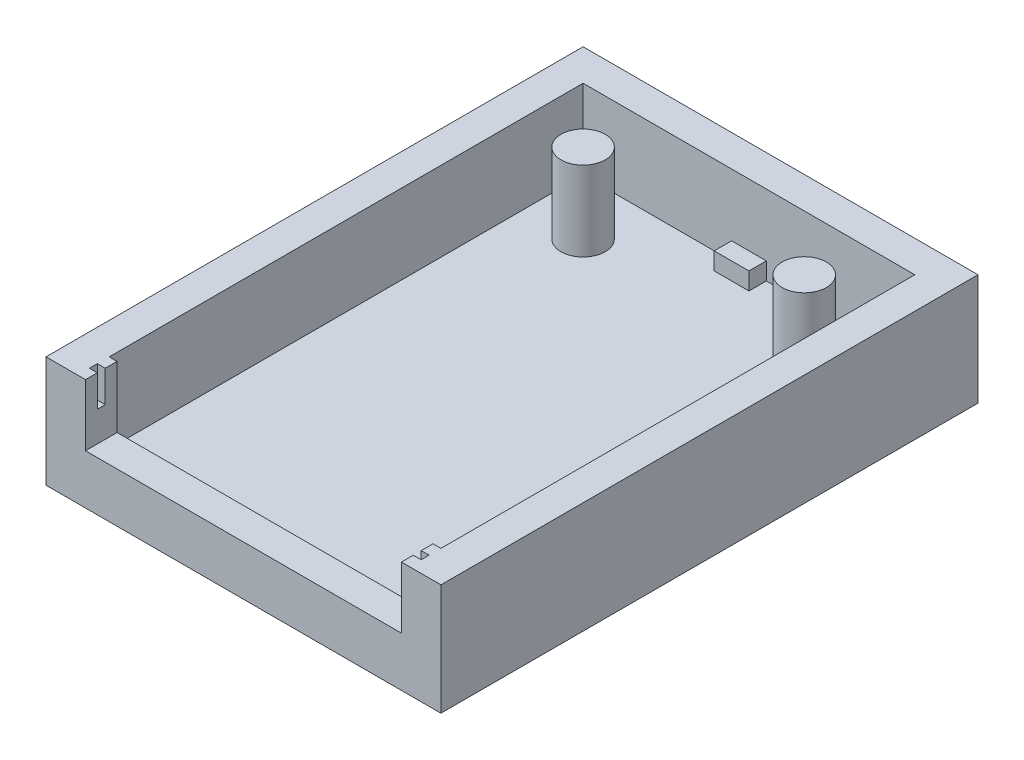
ISO-10303-21;
HEADER;
FILE_DESCRIPTION(('STEP AP214'),'2;1');
FILE_NAME('part.step','',(''),(''),'','','');
FILE_SCHEMA(('AUTOMOTIVE_DESIGN { 1 0 10303 214 1 1 1 1 }'));
ENDSEC;
DATA;
#1=APPLICATION_CONTEXT('core data for automotive mechanical design processes');
#2=APPLICATION_PROTOCOL_DEFINITION('international standard','automotive_design',2000,#1);
#3=PRODUCT_CONTEXT('',#1,'mechanical');
#4=PRODUCT('Part','Part','',(#3));
#5=PRODUCT_RELATED_PRODUCT_CATEGORY('part','',(#4));
#6=PRODUCT_DEFINITION_FORMATION('','',#4);
#7=PRODUCT_DEFINITION_CONTEXT('part definition',#1,'design');
#8=PRODUCT_DEFINITION('design','',#6,#7);
#9=PRODUCT_DEFINITION_SHAPE('','',#8);
#10=(LENGTH_UNIT() NAMED_UNIT(*) SI_UNIT(.MILLI.,.METRE.));
#11=(NAMED_UNIT(*) PLANE_ANGLE_UNIT() SI_UNIT($,.RADIAN.));
#12=(NAMED_UNIT(*) SI_UNIT($,.STERADIAN.) SOLID_ANGLE_UNIT());
#13=UNCERTAINTY_MEASURE_WITH_UNIT(LENGTH_MEASURE(1.E-05),#10,'distance_accuracy_value','');
#14=(GEOMETRIC_REPRESENTATION_CONTEXT(3) GLOBAL_UNCERTAINTY_ASSIGNED_CONTEXT((#13)) GLOBAL_UNIT_ASSIGNED_CONTEXT((#10,
#11,#12)) REPRESENTATION_CONTEXT('',''));
#15=CARTESIAN_POINT('',(0.,0.,0.));
#16=DIRECTION('',(0.,0.,1.));
#17=DIRECTION('',(1.,0.,0.));
#18=AXIS2_PLACEMENT_3D('',#15,#16,#17);
#19=CARTESIAN_POINT('',(-10.5,2.,-15.));
#20=DIRECTION('',(0.,0.,-1.));
#21=DIRECTION('',(-1.,0.,0.));
#22=AXIS2_PLACEMENT_3D('',#19,#20,#21);
#23=PLANE('',#22);
#24=DIRECTION('',(0.,-1.,0.));
#25=VECTOR('',#24,1.);
#26=CARTESIAN_POINT('',(-1.10000000000001,3.1,-15.));
#27=LINE('',#26,#25);
#28=CARTESIAN_POINT('',(-1.10000000000001,3.1,-15.));
#29=VERTEX_POINT('',#28);
#30=CARTESIAN_POINT('',(-1.10000000000001,2.,-15.));
#31=VERTEX_POINT('',#30);
#32=EDGE_CURVE('E284',#29,#31,#27,.T.);
#33=ORIENTED_EDGE('',*,*,#32,.F.);
#34=DIRECTION('',(-1.,0.,0.));
#35=VECTOR('',#34,1.);
#36=CARTESIAN_POINT('',(-1.10000000000001,3.1,-15.));
#37=LINE('',#36,#35);
#38=CARTESIAN_POINT('',(1.10000000000001,3.1,-15.));
#39=VERTEX_POINT('',#38);
#40=EDGE_CURVE('E281',#39,#29,#37,.T.);
#41=ORIENTED_EDGE('',*,*,#40,.F.);
#42=DIRECTION('',(0.,-1.,0.));
#43=VECTOR('',#42,1.);
#44=CARTESIAN_POINT('',(1.10000000000001,3.1,-15.));
#45=LINE('',#44,#43);
#46=CARTESIAN_POINT('',(1.10000000000001,2.,-15.));
#47=VERTEX_POINT('',#46);
#48=EDGE_CURVE('E296',#39,#47,#45,.T.);
#49=ORIENTED_EDGE('',*,*,#48,.T.);
#50=DIRECTION('',(-1.,0.,0.));
#51=VECTOR('',#50,1.);
#52=CARTESIAN_POINT('',(-10.5,2.,-15.));
#53=LINE('',#52,#51);
#54=CARTESIAN_POINT('',(10.5,2.,-15.));
#55=VERTEX_POINT('',#54);
#56=EDGE_CURVE('E357',#55,#47,#53,.T.);
#57=ORIENTED_EDGE('',*,*,#56,.F.);
#58=DIRECTION('',(0.,1.,0.));
#59=VECTOR('',#58,1.);
#60=CARTESIAN_POINT('',(10.5,2.,-15.));
#61=LINE('',#60,#59);
#62=CARTESIAN_POINT('',(10.5,7.04,-15.));
#63=VERTEX_POINT('',#62);
#64=EDGE_CURVE('E369',#55,#63,#61,.T.);
#65=ORIENTED_EDGE('',*,*,#64,.T.);
#66=DIRECTION('',(-1.,0.,0.));
#67=VECTOR('',#66,1.);
#68=CARTESIAN_POINT('',(-10.5,7.04,-15.));
#69=LINE('',#68,#67);
#70=CARTESIAN_POINT('',(-10.5,7.04,-15.));
#71=VERTEX_POINT('',#70);
#72=EDGE_CURVE('E372',#63,#71,#69,.T.);
#73=ORIENTED_EDGE('',*,*,#72,.T.);
#74=DIRECTION('',(0.,1.,0.));
#75=VECTOR('',#74,1.);
#76=CARTESIAN_POINT('',(-10.5,2.,-15.));
#77=LINE('',#76,#75);
#78=CARTESIAN_POINT('',(-10.5,2.,-15.));
#79=VERTEX_POINT('',#78);
#80=EDGE_CURVE('E392',#79,#71,#77,.T.);
#81=ORIENTED_EDGE('',*,*,#80,.F.);
#82=EDGE_CURVE('E355',#31,#79,#53,.T.);
#83=ORIENTED_EDGE('',*,*,#82,.F.);
#84=EDGE_LOOP('',(#33,#41,#49,#57,#65,#73,#81,#83));
#85=FACE_BOUND('',#84,.T.);
#86=ADVANCED_FACE('F44',(#85),#23,.F.);
#87=CARTESIAN_POINT('',(0.,2.,0.));
#88=DIRECTION('',(0.,1.,0.));
#89=DIRECTION('',(0.,0.,1.));
#90=AXIS2_PLACEMENT_3D('',#87,#88,#89);
#91=PLANE('',#90);
#92=CARTESIAN_POINT('',(7.,2.,-11.5));
#93=DIRECTION('',(0.,1.,0.));
#94=DIRECTION('',(0.,0.,1.));
#95=AXIS2_PLACEMENT_3D('',#92,#93,#94);
#96=CIRCLE('',#95,1.4);
#97=CARTESIAN_POINT('',(7.,2.,-10.1));
#98=VERTEX_POINT('',#97);
#99=EDGE_CURVE('E335',#98,#98,#96,.T.);
#100=ORIENTED_EDGE('',*,*,#99,.F.);
#101=EDGE_LOOP('',(#100));
#102=FACE_BOUND('',#101,.T.);
#103=CARTESIAN_POINT('',(-7.,2.,-11.5));
#104=DIRECTION('',(0.,1.,0.));
#105=DIRECTION('',(0.,0.,1.));
#106=AXIS2_PLACEMENT_3D('',#103,#104,#105);
#107=CIRCLE('',#106,1.4);
#108=CARTESIAN_POINT('',(-7.,2.,-10.1));
#109=VERTEX_POINT('',#108);
#110=EDGE_CURVE('E343',#109,#109,#107,.T.);
#111=ORIENTED_EDGE('',*,*,#110,.F.);
#112=EDGE_LOOP('',(#111));
#113=FACE_BOUND('',#112,.T.);
#114=DIRECTION('',(1.,0.,0.));
#115=VECTOR('',#114,1.);
#116=CARTESIAN_POINT('',(-1.09999999999999,2.,-13.9));
#117=LINE('',#116,#115);
#118=CARTESIAN_POINT('',(-1.09999999999999,2.,-13.9));
#119=VERTEX_POINT('',#118);
#120=CARTESIAN_POINT('',(1.10000000000001,2.,-13.9));
#121=VERTEX_POINT('',#120);
#122=EDGE_CURVE('E288',#119,#121,#117,.T.);
#123=ORIENTED_EDGE('',*,*,#122,.F.);
#124=DIRECTION('',(0.,0.,1.));
#125=VECTOR('',#124,1.);
#126=CARTESIAN_POINT('',(-1.10000000000001,2.,-15.));
#127=LINE('',#126,#125);
#128=EDGE_CURVE('E244',#31,#119,#127,.T.);
#129=ORIENTED_EDGE('',*,*,#128,.F.);
#130=ORIENTED_EDGE('',*,*,#82,.T.);
#131=DIRECTION('',(0.,0.,1.));
#132=VECTOR('',#131,1.);
#133=CARTESIAN_POINT('',(-10.5,2.,-15.));
#134=LINE('',#133,#132);
#135=CARTESIAN_POINT('',(-10.5,2.,15.));
#136=VERTEX_POINT('',#135);
#137=EDGE_CURVE('E361',#79,#136,#134,.T.);
#138=ORIENTED_EDGE('',*,*,#137,.T.);
#139=DIRECTION('',(1.,0.,0.));
#140=VECTOR('',#139,1.);
#141=CARTESIAN_POINT('',(-10.5,2.,15.));
#142=LINE('',#141,#140);
#143=CARTESIAN_POINT('',(10.5,2.,15.));
#144=VERTEX_POINT('',#143);
#145=EDGE_CURVE('E365',#136,#144,#142,.T.);
#146=ORIENTED_EDGE('',*,*,#145,.T.);
#147=DIRECTION('',(0.,0.,-1.));
#148=VECTOR('',#147,1.);
#149=CARTESIAN_POINT('',(10.5,2.,-15.));
#150=LINE('',#149,#148);
#151=EDGE_CURVE('E351',#144,#55,#150,.T.);
#152=ORIENTED_EDGE('',*,*,#151,.T.);
#153=ORIENTED_EDGE('',*,*,#56,.T.);
#154=DIRECTION('',(0.,0.,-1.));
#155=VECTOR('',#154,1.);
#156=CARTESIAN_POINT('',(1.10000000000001,2.,-15.));
#157=LINE('',#156,#155);
#158=EDGE_CURVE('E275',#121,#47,#157,.T.);
#159=ORIENTED_EDGE('',*,*,#158,.F.);
#160=EDGE_LOOP('',(#123,#129,#130,#138,#146,#152,#153,#159));
#161=FACE_BOUND('',#160,.T.);
#162=ADVANCED_FACE('F533',(#102,#113,#161),#91,.T.);
#163=CARTESIAN_POINT('',(12.5,7.04,-17.));
#164=DIRECTION('',(-1.,0.,0.));
#165=DIRECTION('',(0.,0.,1.));
#166=AXIS2_PLACEMENT_3D('',#163,#164,#165);
#167=PLANE('',#166);
#168=DIRECTION('',(0.,0.,-1.));
#169=VECTOR('',#168,1.);
#170=CARTESIAN_POINT('',(12.5,0.,-17.));
#171=LINE('',#170,#169);
#172=CARTESIAN_POINT('',(12.5,0.,17.));
#173=VERTEX_POINT('',#172);
#174=CARTESIAN_POINT('',(12.5,0.,-17.));
#175=VERTEX_POINT('',#174);
#176=EDGE_CURVE('E388',#173,#175,#171,.T.);
#177=ORIENTED_EDGE('',*,*,#176,.T.);
#178=DIRECTION('',(0.,-1.,0.));
#179=VECTOR('',#178,1.);
#180=CARTESIAN_POINT('',(12.5,7.04,-17.));
#181=LINE('',#180,#179);
#182=CARTESIAN_POINT('',(12.5,7.04,-17.));
#183=VERTEX_POINT('',#182);
#184=EDGE_CURVE('E437',#183,#175,#181,.T.);
#185=ORIENTED_EDGE('',*,*,#184,.F.);
#186=DIRECTION('',(0.,0.,-1.));
#187=VECTOR('',#186,1.);
#188=CARTESIAN_POINT('',(12.5,7.04,-17.));
#189=LINE('',#188,#187);
#190=CARTESIAN_POINT('',(12.5,7.04,17.));
#191=VERTEX_POINT('',#190);
#192=EDGE_CURVE('E398',#191,#183,#189,.T.);
#193=ORIENTED_EDGE('',*,*,#192,.F.);
#194=DIRECTION('',(0.,-1.,0.));
#195=VECTOR('',#194,1.);
#196=CARTESIAN_POINT('',(12.5,7.04,17.));
#197=LINE('',#196,#195);
#198=EDGE_CURVE('E414',#191,#173,#197,.T.);
#199=ORIENTED_EDGE('',*,*,#198,.T.);
#200=EDGE_LOOP('',(#177,#185,#193,#199));
#201=FACE_BOUND('',#200,.T.);
#202=ADVANCED_FACE('F46',(#201),#167,.F.);
#203=CARTESIAN_POINT('',(-12.5,7.04,-17.));
#204=DIRECTION('',(0.,0.,1.));
#205=DIRECTION('',(1.,0.,0.));
#206=AXIS2_PLACEMENT_3D('',#203,#204,#205);
#207=PLANE('',#206);
#208=DIRECTION('',(-1.,0.,0.));
#209=VECTOR('',#208,1.);
#210=CARTESIAN_POINT('',(-12.5,0.,-17.));
#211=LINE('',#210,#209);
#212=CARTESIAN_POINT('',(-12.5,0.,-17.));
#213=VERTEX_POINT('',#212);
#214=EDGE_CURVE('E418',#175,#213,#211,.T.);
#215=ORIENTED_EDGE('',*,*,#214,.T.);
#216=DIRECTION('',(0.,-1.,0.));
#217=VECTOR('',#216,1.);
#218=CARTESIAN_POINT('',(-12.5,7.04,-17.));
#219=LINE('',#218,#217);
#220=CARTESIAN_POINT('',(-12.5,7.04,-17.));
#221=VERTEX_POINT('',#220);
#222=EDGE_CURVE('E433',#221,#213,#219,.T.);
#223=ORIENTED_EDGE('',*,*,#222,.F.);
#224=DIRECTION('',(-1.,0.,0.));
#225=VECTOR('',#224,1.);
#226=CARTESIAN_POINT('',(-12.5,7.04,-17.));
#227=LINE('',#226,#225);
#228=EDGE_CURVE('E402',#183,#221,#227,.T.);
#229=ORIENTED_EDGE('',*,*,#228,.F.);
#230=ORIENTED_EDGE('',*,*,#184,.T.);
#231=EDGE_LOOP('',(#215,#223,#229,#230));
#232=FACE_BOUND('',#231,.T.);
#233=ADVANCED_FACE('F495',(#232),#207,.F.);
#234=CARTESIAN_POINT('',(-12.5,7.04,-17.));
#235=DIRECTION('',(1.,0.,0.));
#236=DIRECTION('',(0.,0.,-1.));
#237=AXIS2_PLACEMENT_3D('',#234,#235,#236);
#238=PLANE('',#237);
#239=DIRECTION('',(0.,0.,1.));
#240=VECTOR('',#239,1.);
#241=CARTESIAN_POINT('',(-12.5,0.,-17.));
#242=LINE('',#241,#240);
#243=CARTESIAN_POINT('',(-12.5,0.,17.));
#244=VERTEX_POINT('',#243);
#245=EDGE_CURVE('E421',#213,#244,#242,.T.);
#246=ORIENTED_EDGE('',*,*,#245,.T.);
#247=DIRECTION('',(0.,-1.,0.));
#248=VECTOR('',#247,1.);
#249=CARTESIAN_POINT('',(-12.5,7.04,17.));
#250=LINE('',#249,#248);
#251=CARTESIAN_POINT('',(-12.5,7.04,17.));
#252=VERTEX_POINT('',#251);
#253=EDGE_CURVE('E429',#252,#244,#250,.T.);
#254=ORIENTED_EDGE('',*,*,#253,.F.);
#255=DIRECTION('',(0.,0.,1.));
#256=VECTOR('',#255,1.);
#257=CARTESIAN_POINT('',(-12.5,7.04,-17.));
#258=LINE('',#257,#256);
#259=EDGE_CURVE('E406',#221,#252,#258,.T.);
#260=ORIENTED_EDGE('',*,*,#259,.F.);
#261=ORIENTED_EDGE('',*,*,#222,.T.);
#262=EDGE_LOOP('',(#246,#254,#260,#261));
#263=FACE_BOUND('',#262,.T.);
#264=ADVANCED_FACE('F502',(#263),#238,.F.);
#265=CARTESIAN_POINT('',(-12.5,7.04,17.));
#266=DIRECTION('',(0.,0.,-1.));
#267=DIRECTION('',(-1.,0.,0.));
#268=AXIS2_PLACEMENT_3D('',#265,#266,#267);
#269=PLANE('',#268);
#270=DIRECTION('',(1.,0.,0.));
#271=VECTOR('',#270,1.);
#272=CARTESIAN_POINT('',(-12.5,7.04,17.));
#273=LINE('',#272,#271);
#274=CARTESIAN_POINT('',(10.,7.04,17.));
#275=VERTEX_POINT('',#274);
#276=EDGE_CURVE('E409',#275,#191,#273,.T.);
#277=ORIENTED_EDGE('',*,*,#276,.F.);
#278=DIRECTION('',(0.,-1.,0.));
#279=VECTOR('',#278,1.);
#280=CARTESIAN_POINT('',(10.,7.04,17.));
#281=LINE('',#280,#279);
#282=CARTESIAN_POINT('',(10.,3.14,17.));
#283=VERTEX_POINT('',#282);
#284=EDGE_CURVE('E330',#275,#283,#281,.T.);
#285=ORIENTED_EDGE('',*,*,#284,.T.);
#286=DIRECTION('',(1.,0.,0.));
#287=VECTOR('',#286,1.);
#288=CARTESIAN_POINT('',(-12.5,3.14,17.));
#289=LINE('',#288,#287);
#290=CARTESIAN_POINT('',(-10.,3.14,17.));
#291=VERTEX_POINT('',#290);
#292=EDGE_CURVE('E315',#291,#283,#289,.T.);
#293=ORIENTED_EDGE('',*,*,#292,.F.);
#294=DIRECTION('',(0.,1.,0.));
#295=VECTOR('',#294,1.);
#296=CARTESIAN_POINT('',(-10.,7.04,17.));
#297=LINE('',#296,#295);
#298=CARTESIAN_POINT('',(-10.,7.04,17.));
#299=VERTEX_POINT('',#298);
#300=EDGE_CURVE('E326',#291,#299,#297,.T.);
#301=ORIENTED_EDGE('',*,*,#300,.T.);
#302=EDGE_CURVE('E410',#252,#299,#273,.T.);
#303=ORIENTED_EDGE('',*,*,#302,.F.);
#304=ORIENTED_EDGE('',*,*,#253,.T.);
#305=DIRECTION('',(1.,0.,0.));
#306=VECTOR('',#305,1.);
#307=CARTESIAN_POINT('',(-12.5,0.,17.));
#308=LINE('',#307,#306);
#309=EDGE_CURVE('E403',#244,#173,#308,.T.);
#310=ORIENTED_EDGE('',*,*,#309,.T.);
#311=ORIENTED_EDGE('',*,*,#198,.F.);
#312=EDGE_LOOP('',(#277,#285,#293,#301,#303,#304,#310,#311));
#313=FACE_BOUND('',#312,.T.);
#314=ADVANCED_FACE('F490',(#313),#269,.F.);
#315=CARTESIAN_POINT('',(0.,7.04,0.));
#316=DIRECTION('',(0.,1.,0.));
#317=DIRECTION('',(0.,0.,1.));
#318=AXIS2_PLACEMENT_3D('',#315,#316,#317);
#319=PLANE('',#318);
#320=DIRECTION('',(1.,0.,0.));
#321=VECTOR('',#320,1.);
#322=CARTESIAN_POINT('',(-10.5,7.04,16.25));
#323=LINE('',#322,#321);
#324=CARTESIAN_POINT('',(-10.5,7.04,16.25));
#325=VERTEX_POINT('',#324);
#326=CARTESIAN_POINT('',(-10.,7.04,16.25));
#327=VERTEX_POINT('',#326);
#328=EDGE_CURVE('E216',#325,#327,#323,.T.);
#329=ORIENTED_EDGE('',*,*,#328,.F.);
#330=DIRECTION('',(0.,0.,1.));
#331=VECTOR('',#330,1.);
#332=CARTESIAN_POINT('',(-10.5,7.04,15.75));
#333=LINE('',#332,#331);
#334=CARTESIAN_POINT('',(-10.5,7.04,15.75));
#335=VERTEX_POINT('',#334);
#336=EDGE_CURVE('E237',#335,#325,#333,.T.);
#337=ORIENTED_EDGE('',*,*,#336,.F.);
#338=DIRECTION('',(-1.,0.,0.));
#339=VECTOR('',#338,1.);
#340=CARTESIAN_POINT('',(-10.5,7.04,15.75));
#341=LINE('',#340,#339);
#342=CARTESIAN_POINT('',(-10.,7.04,15.75));
#343=VERTEX_POINT('',#342);
#344=EDGE_CURVE('E222',#343,#335,#341,.T.);
#345=ORIENTED_EDGE('',*,*,#344,.F.);
#346=DIRECTION('',(0.,0.,1.));
#347=VECTOR('',#346,1.);
#348=CARTESIAN_POINT('',(-10.,7.04,11.9632553201311));
#349=LINE('',#348,#347);
#350=CARTESIAN_POINT('',(-10.,7.04,15.));
#351=VERTEX_POINT('',#350);
#352=EDGE_CURVE('E311',#351,#343,#349,.T.);
#353=ORIENTED_EDGE('',*,*,#352,.F.);
#354=DIRECTION('',(1.,0.,0.));
#355=VECTOR('',#354,1.);
#356=CARTESIAN_POINT('',(-10.5,7.04,15.));
#357=LINE('',#356,#355);
#358=CARTESIAN_POINT('',(-10.5,7.04,15.));
#359=VERTEX_POINT('',#358);
#360=EDGE_CURVE('E356',#359,#351,#357,.T.);
#361=ORIENTED_EDGE('',*,*,#360,.F.);
#362=DIRECTION('',(0.,0.,1.));
#363=VECTOR('',#362,1.);
#364=CARTESIAN_POINT('',(-10.5,7.04,-15.));
#365=LINE('',#364,#363);
#366=EDGE_CURVE('E376',#71,#359,#365,.T.);
#367=ORIENTED_EDGE('',*,*,#366,.F.);
#368=ORIENTED_EDGE('',*,*,#72,.F.);
#369=DIRECTION('',(0.,0.,-1.));
#370=VECTOR('',#369,1.);
#371=CARTESIAN_POINT('',(10.5,7.04,-15.));
#372=LINE('',#371,#370);
#373=CARTESIAN_POINT('',(10.5,7.04,15.));
#374=VERTEX_POINT('',#373);
#375=EDGE_CURVE('E347',#374,#63,#372,.T.);
#376=ORIENTED_EDGE('',*,*,#375,.F.);
#377=CARTESIAN_POINT('',(10.,7.04,15.));
#378=VERTEX_POINT('',#377);
#379=EDGE_CURVE('E380',#378,#374,#357,.T.);
#380=ORIENTED_EDGE('',*,*,#379,.F.);
#381=DIRECTION('',(0.,0.,-1.));
#382=VECTOR('',#381,1.);
#383=CARTESIAN_POINT('',(10.,7.04,11.9632553201311));
#384=LINE('',#383,#382);
#385=CARTESIAN_POINT('',(10.,7.04,15.75));
#386=VERTEX_POINT('',#385);
#387=EDGE_CURVE('E306',#386,#378,#384,.T.);
#388=ORIENTED_EDGE('',*,*,#387,.F.);
#389=DIRECTION('',(-1.,0.,0.));
#390=VECTOR('',#389,1.);
#391=CARTESIAN_POINT('',(9.50000000000001,7.04,15.75));
#392=LINE('',#391,#390);
#393=CARTESIAN_POINT('',(10.5,7.04,15.75));
#394=VERTEX_POINT('',#393);
#395=EDGE_CURVE('E257',#394,#386,#392,.T.);
#396=ORIENTED_EDGE('',*,*,#395,.F.);
#397=DIRECTION('',(0.,0.,-1.));
#398=VECTOR('',#397,1.);
#399=CARTESIAN_POINT('',(10.5,7.04,15.75));
#400=LINE('',#399,#398);
#401=CARTESIAN_POINT('',(10.5,7.04,16.25));
#402=VERTEX_POINT('',#401);
#403=EDGE_CURVE('E238',#402,#394,#400,.T.);
#404=ORIENTED_EDGE('',*,*,#403,.F.);
#405=DIRECTION('',(1.,0.,0.));
#406=VECTOR('',#405,1.);
#407=CARTESIAN_POINT('',(9.50000000000001,7.04,16.25));
#408=LINE('',#407,#406);
#409=CARTESIAN_POINT('',(10.,7.04,16.25));
#410=VERTEX_POINT('',#409);
#411=EDGE_CURVE('E254',#410,#402,#408,.T.);
#412=ORIENTED_EDGE('',*,*,#411,.F.);
#413=EDGE_CURVE('E316',#275,#410,#384,.T.);
#414=ORIENTED_EDGE('',*,*,#413,.F.);
#415=ORIENTED_EDGE('',*,*,#276,.T.);
#416=ORIENTED_EDGE('',*,*,#192,.T.);
#417=ORIENTED_EDGE('',*,*,#228,.T.);
#418=ORIENTED_EDGE('',*,*,#259,.T.);
#419=ORIENTED_EDGE('',*,*,#302,.T.);
#420=EDGE_CURVE('E320',#327,#299,#349,.T.);
#421=ORIENTED_EDGE('',*,*,#420,.F.);
#422=EDGE_LOOP('',(#329,#337,#345,#353,#361,#367,#368,#376,#380,#388,#396,#404,#412,#414,#415,
#416,#417,#418,#419,#421));
#423=FACE_BOUND('',#422,.T.);
#424=ADVANCED_FACE('F475',(#423),#319,.T.);
#425=CARTESIAN_POINT('',(0.,0.,0.));
#426=DIRECTION('',(0.,1.,0.));
#427=DIRECTION('',(0.,0.,1.));
#428=AXIS2_PLACEMENT_3D('',#425,#426,#427);
#429=PLANE('',#428);
#430=ORIENTED_EDGE('',*,*,#176,.F.);
#431=ORIENTED_EDGE('',*,*,#309,.F.);
#432=ORIENTED_EDGE('',*,*,#245,.F.);
#433=ORIENTED_EDGE('',*,*,#214,.F.);
#434=EDGE_LOOP('',(#430,#431,#432,#433));
#435=FACE_BOUND('',#434,.T.);
#436=ADVANCED_FACE('F549',(#435),#429,.F.);
#437=CARTESIAN_POINT('',(10.5,2.,-15.));
#438=DIRECTION('',(1.,0.,0.));
#439=DIRECTION('',(0.,0.,-1.));
#440=AXIS2_PLACEMENT_3D('',#437,#438,#439);
#441=PLANE('',#440);
#442=ORIENTED_EDGE('',*,*,#375,.T.);
#443=ORIENTED_EDGE('',*,*,#64,.F.);
#444=ORIENTED_EDGE('',*,*,#151,.F.);
#445=DIRECTION('',(0.,1.,0.));
#446=VECTOR('',#445,1.);
#447=CARTESIAN_POINT('',(10.5,2.,15.));
#448=LINE('',#447,#446);
#449=EDGE_CURVE('E384',#144,#374,#448,.T.);
#450=ORIENTED_EDGE('',*,*,#449,.T.);
#451=EDGE_LOOP('',(#442,#443,#444,#450));
#452=FACE_BOUND('',#451,.T.);
#453=ADVANCED_FACE('F546',(#452),#441,.F.);
#454=CARTESIAN_POINT('',(-10.5,2.,15.));
#455=DIRECTION('',(0.,0.,1.));
#456=DIRECTION('',(1.,0.,0.));
#457=AXIS2_PLACEMENT_3D('',#454,#455,#456);
#458=PLANE('',#457);
#459=DIRECTION('',(-1.,0.,0.));
#460=VECTOR('',#459,1.);
#461=CARTESIAN_POINT('',(-10.5,3.14,15.));
#462=LINE('',#461,#460);
#463=CARTESIAN_POINT('',(10.,3.14,15.));
#464=VERTEX_POINT('',#463);
#465=CARTESIAN_POINT('',(-10.,3.14,15.));
#466=VERTEX_POINT('',#465);
#467=EDGE_CURVE('E441',#464,#466,#462,.T.);
#468=ORIENTED_EDGE('',*,*,#467,.F.);
#469=DIRECTION('',(0.,1.,0.));
#470=VECTOR('',#469,1.);
#471=CARTESIAN_POINT('',(10.,2.,15.));
#472=LINE('',#471,#470);
#473=EDGE_CURVE('E448',#464,#378,#472,.T.);
#474=ORIENTED_EDGE('',*,*,#473,.T.);
#475=ORIENTED_EDGE('',*,*,#379,.T.);
#476=ORIENTED_EDGE('',*,*,#449,.F.);
#477=ORIENTED_EDGE('',*,*,#145,.F.);
#478=DIRECTION('',(0.,1.,0.));
#479=VECTOR('',#478,1.);
#480=CARTESIAN_POINT('',(-10.5,2.,15.));
#481=LINE('',#480,#479);
#482=EDGE_CURVE('E389',#136,#359,#481,.T.);
#483=ORIENTED_EDGE('',*,*,#482,.T.);
#484=ORIENTED_EDGE('',*,*,#360,.T.);
#485=DIRECTION('',(0.,-1.,0.));
#486=VECTOR('',#485,1.);
#487=CARTESIAN_POINT('',(-10.,2.,15.));
#488=LINE('',#487,#486);
#489=EDGE_CURVE('E444',#351,#466,#488,.T.);
#490=ORIENTED_EDGE('',*,*,#489,.T.);
#491=EDGE_LOOP('',(#468,#474,#475,#476,#477,#483,#484,#490));
#492=FACE_BOUND('',#491,.T.);
#493=ADVANCED_FACE('F513',(#492),#458,.F.);
#494=CARTESIAN_POINT('',(-10.5,2.,-15.));
#495=DIRECTION('',(-1.,0.,0.));
#496=DIRECTION('',(0.,0.,1.));
#497=AXIS2_PLACEMENT_3D('',#494,#495,#496);
#498=PLANE('',#497);
#499=ORIENTED_EDGE('',*,*,#366,.T.);
#500=ORIENTED_EDGE('',*,*,#482,.F.);
#501=ORIENTED_EDGE('',*,*,#137,.F.);
#502=ORIENTED_EDGE('',*,*,#80,.T.);
#503=EDGE_LOOP('',(#499,#500,#501,#502));
#504=FACE_BOUND('',#503,.T.);
#505=ADVANCED_FACE('F544',(#504),#498,.F.);
#506=CARTESIAN_POINT('',(-7.,2.,-11.5));
#507=DIRECTION('',(0.,1.,0.));
#508=DIRECTION('',(0.,0.,1.));
#509=AXIS2_PLACEMENT_3D('',#506,#507,#508);
#510=CYLINDRICAL_SURFACE('',#509,1.4);
#511=ORIENTED_EDGE('',*,*,#110,.T.);
#512=EDGE_LOOP('',(#511));
#513=FACE_BOUND('',#512,.T.);
#514=CARTESIAN_POINT('',(-7.,7.04,-11.5));
#515=DIRECTION('',(0.,1.,0.));
#516=DIRECTION('',(0.,0.,1.));
#517=AXIS2_PLACEMENT_3D('',#514,#515,#516);
#518=CIRCLE('',#517,1.4);
#519=CARTESIAN_POINT('',(-7.,7.04,-10.1));
#520=VERTEX_POINT('',#519);
#521=EDGE_CURVE('E339',#520,#520,#518,.T.);
#522=ORIENTED_EDGE('',*,*,#521,.F.);
#523=EDGE_LOOP('',(#522));
#524=FACE_BOUND('',#523,.T.);
#525=ADVANCED_FACE('F651',(#513,#524),#510,.T.);
#526=CARTESIAN_POINT('',(7.,2.,-11.5));
#527=DIRECTION('',(0.,1.,0.));
#528=DIRECTION('',(0.,0.,1.));
#529=AXIS2_PLACEMENT_3D('',#526,#527,#528);
#530=CYLINDRICAL_SURFACE('',#529,1.4);
#531=ORIENTED_EDGE('',*,*,#99,.T.);
#532=EDGE_LOOP('',(#531));
#533=FACE_BOUND('',#532,.T.);
#534=CARTESIAN_POINT('',(7.,7.04,-11.5));
#535=DIRECTION('',(0.,1.,0.));
#536=DIRECTION('',(0.,0.,1.));
#537=AXIS2_PLACEMENT_3D('',#534,#535,#536);
#538=CIRCLE('',#537,1.4);
#539=CARTESIAN_POINT('',(7.,7.04,-10.1));
#540=VERTEX_POINT('',#539);
#541=EDGE_CURVE('E334',#540,#540,#538,.T.);
#542=ORIENTED_EDGE('',*,*,#541,.F.);
#543=EDGE_LOOP('',(#542));
#544=FACE_BOUND('',#543,.T.);
#545=ADVANCED_FACE('F640',(#533,#544),#530,.T.);
#546=ORIENTED_EDGE('',*,*,#521,.T.);
#547=EDGE_LOOP('',(#546));
#548=FACE_BOUND('',#547,.T.);
#549=ADVANCED_FACE('F553',(#548),#319,.T.);
#550=ORIENTED_EDGE('',*,*,#541,.T.);
#551=EDGE_LOOP('',(#550));
#552=FACE_BOUND('',#551,.T.);
#553=ADVANCED_FACE('F554',(#552),#319,.T.);
#554=CARTESIAN_POINT('',(10.,3.14,11.9632553201311));
#555=DIRECTION('',(1.,0.,0.));
#556=DIRECTION('',(0.,0.,-1.));
#557=AXIS2_PLACEMENT_3D('',#554,#555,#556);
#558=PLANE('',#557);
#559=ORIENTED_EDGE('',*,*,#413,.T.);
#560=DIRECTION('',(0.,-1.,0.));
#561=VECTOR('',#560,1.);
#562=CARTESIAN_POINT('',(10.,3.14,16.25));
#563=LINE('',#562,#561);
#564=CARTESIAN_POINT('',(10.,5.04,16.25));
#565=VERTEX_POINT('',#564);
#566=EDGE_CURVE('E11',#410,#565,#563,.T.);
#567=ORIENTED_EDGE('',*,*,#566,.T.);
#568=DIRECTION('',(0.,0.,1.));
#569=VECTOR('',#568,1.);
#570=CARTESIAN_POINT('',(10.,5.04,11.9632553201311));
#571=LINE('',#570,#569);
#572=CARTESIAN_POINT('',(10.,5.04,15.75));
#573=VERTEX_POINT('',#572);
#574=EDGE_CURVE('E461',#573,#565,#571,.T.);
#575=ORIENTED_EDGE('',*,*,#574,.F.);
#576=DIRECTION('',(0.,1.,0.));
#577=VECTOR('',#576,1.);
#578=CARTESIAN_POINT('',(10.,3.14,15.75));
#579=LINE('',#578,#577);
#580=EDGE_CURVE('E53',#573,#386,#579,.T.);
#581=ORIENTED_EDGE('',*,*,#580,.T.);
#582=ORIENTED_EDGE('',*,*,#387,.T.);
#583=ORIENTED_EDGE('',*,*,#473,.F.);
#584=DIRECTION('',(0.,0.,-1.));
#585=VECTOR('',#584,1.);
#586=CARTESIAN_POINT('',(10.,3.14,11.9632553201311));
#587=LINE('',#586,#585);
#588=EDGE_CURVE('E307',#283,#464,#587,.T.);
#589=ORIENTED_EDGE('',*,*,#588,.F.);
#590=ORIENTED_EDGE('',*,*,#284,.F.);
#591=EDGE_LOOP('',(#559,#567,#575,#581,#582,#583,#589,#590));
#592=FACE_BOUND('',#591,.T.);
#593=ADVANCED_FACE('F468',(#592),#558,.F.);
#594=CARTESIAN_POINT('',(-10.,3.14,11.9632553201311));
#595=DIRECTION('',(-1.,0.,0.));
#596=DIRECTION('',(0.,0.,1.));
#597=AXIS2_PLACEMENT_3D('',#594,#595,#596);
#598=PLANE('',#597);
#599=DIRECTION('',(0.,0.,-1.));
#600=VECTOR('',#599,1.);
#601=CARTESIAN_POINT('',(-10.,5.04,11.9632553201311));
#602=LINE('',#601,#600);
#603=CARTESIAN_POINT('',(-10.,5.04,16.25));
#604=VERTEX_POINT('',#603);
#605=CARTESIAN_POINT('',(-10.,5.04,15.75));
#606=VERTEX_POINT('',#605);
#607=EDGE_CURVE('E212',#604,#606,#602,.T.);
#608=ORIENTED_EDGE('',*,*,#607,.F.);
#609=DIRECTION('',(0.,1.,0.));
#610=VECTOR('',#609,1.);
#611=CARTESIAN_POINT('',(-10.,3.14,16.25));
#612=LINE('',#611,#610);
#613=EDGE_CURVE('E457',#604,#327,#612,.T.);
#614=ORIENTED_EDGE('',*,*,#613,.T.);
#615=ORIENTED_EDGE('',*,*,#420,.T.);
#616=ORIENTED_EDGE('',*,*,#300,.F.);
#617=DIRECTION('',(0.,0.,1.));
#618=VECTOR('',#617,1.);
#619=CARTESIAN_POINT('',(-10.,3.14,11.9632553201311));
#620=LINE('',#619,#618);
#621=EDGE_CURVE('E310',#466,#291,#620,.T.);
#622=ORIENTED_EDGE('',*,*,#621,.F.);
#623=ORIENTED_EDGE('',*,*,#489,.F.);
#624=ORIENTED_EDGE('',*,*,#352,.T.);
#625=DIRECTION('',(0.,-1.,0.));
#626=VECTOR('',#625,1.);
#627=CARTESIAN_POINT('',(-10.,3.14,15.75));
#628=LINE('',#627,#626);
#629=EDGE_CURVE('E454',#343,#606,#628,.T.);
#630=ORIENTED_EDGE('',*,*,#629,.T.);
#631=EDGE_LOOP('',(#608,#614,#615,#616,#622,#623,#624,#630));
#632=FACE_BOUND('',#631,.T.);
#633=ADVANCED_FACE('F507',(#632),#598,.F.);
#634=CARTESIAN_POINT('',(0.,3.14,0.));
#635=DIRECTION('',(0.,1.,0.));
#636=DIRECTION('',(0.,0.,1.));
#637=AXIS2_PLACEMENT_3D('',#634,#635,#636);
#638=PLANE('',#637);
#639=ORIENTED_EDGE('',*,*,#292,.T.);
#640=ORIENTED_EDGE('',*,*,#588,.T.);
#641=ORIENTED_EDGE('',*,*,#467,.T.);
#642=ORIENTED_EDGE('',*,*,#621,.T.);
#643=EDGE_LOOP('',(#639,#640,#641,#642));
#644=FACE_BOUND('',#643,.T.);
#645=ADVANCED_FACE('F509',(#644),#638,.T.);
#646=CARTESIAN_POINT('',(-1.10000000000001,3.1,-15.));
#647=DIRECTION('',(1.,0.,0.));
#648=DIRECTION('',(0.,0.,-1.));
#649=AXIS2_PLACEMENT_3D('',#646,#647,#648);
#650=PLANE('',#649);
#651=ORIENTED_EDGE('',*,*,#128,.T.);
#652=DIRECTION('',(0.,-1.,0.));
#653=VECTOR('',#652,1.);
#654=CARTESIAN_POINT('',(-1.09999999999999,3.1,-13.9));
#655=LINE('',#654,#653);
#656=CARTESIAN_POINT('',(-1.09999999999999,3.1,-13.9));
#657=VERTEX_POINT('',#656);
#658=EDGE_CURVE('E303',#657,#119,#655,.T.);
#659=ORIENTED_EDGE('',*,*,#658,.F.);
#660=DIRECTION('',(0.,0.,1.));
#661=VECTOR('',#660,1.);
#662=CARTESIAN_POINT('',(-1.10000000000001,3.1,-15.));
#663=LINE('',#662,#661);
#664=EDGE_CURVE('E270',#29,#657,#663,.T.);
#665=ORIENTED_EDGE('',*,*,#664,.F.);
#666=ORIENTED_EDGE('',*,*,#32,.T.);
#667=EDGE_LOOP('',(#651,#659,#665,#666));
#668=FACE_BOUND('',#667,.T.);
#669=ADVANCED_FACE('F589',(#668),#650,.F.);
#670=CARTESIAN_POINT('',(-1.09999999999999,3.1,-13.9));
#671=DIRECTION('',(0.,0.,-1.));
#672=DIRECTION('',(-1.,0.,0.));
#673=AXIS2_PLACEMENT_3D('',#670,#671,#672);
#674=PLANE('',#673);
#675=ORIENTED_EDGE('',*,*,#122,.T.);
#676=DIRECTION('',(0.,-1.,0.));
#677=VECTOR('',#676,1.);
#678=CARTESIAN_POINT('',(1.10000000000001,3.1,-13.9));
#679=LINE('',#678,#677);
#680=CARTESIAN_POINT('',(1.10000000000001,3.1,-13.9));
#681=VERTEX_POINT('',#680);
#682=EDGE_CURVE('E300',#681,#121,#679,.T.);
#683=ORIENTED_EDGE('',*,*,#682,.F.);
#684=DIRECTION('',(1.,0.,0.));
#685=VECTOR('',#684,1.);
#686=CARTESIAN_POINT('',(-1.09999999999999,3.1,-13.9));
#687=LINE('',#686,#685);
#688=EDGE_CURVE('E274',#657,#681,#687,.T.);
#689=ORIENTED_EDGE('',*,*,#688,.F.);
#690=ORIENTED_EDGE('',*,*,#658,.T.);
#691=EDGE_LOOP('',(#675,#683,#689,#690));
#692=FACE_BOUND('',#691,.T.);
#693=ADVANCED_FACE('F747',(#692),#674,.F.);
#694=CARTESIAN_POINT('',(1.10000000000001,3.1,-15.));
#695=DIRECTION('',(-1.,0.,0.));
#696=DIRECTION('',(0.,0.,1.));
#697=AXIS2_PLACEMENT_3D('',#694,#695,#696);
#698=PLANE('',#697);
#699=ORIENTED_EDGE('',*,*,#158,.T.);
#700=ORIENTED_EDGE('',*,*,#48,.F.);
#701=DIRECTION('',(0.,0.,-1.));
#702=VECTOR('',#701,1.);
#703=CARTESIAN_POINT('',(1.10000000000001,3.1,-15.));
#704=LINE('',#703,#702);
#705=EDGE_CURVE('E278',#681,#39,#704,.T.);
#706=ORIENTED_EDGE('',*,*,#705,.F.);
#707=ORIENTED_EDGE('',*,*,#682,.T.);
#708=EDGE_LOOP('',(#699,#700,#706,#707));
#709=FACE_BOUND('',#708,.T.);
#710=ADVANCED_FACE('F527',(#709),#698,.F.);
#711=CARTESIAN_POINT('',(0.,3.1,0.));
#712=DIRECTION('',(0.,1.,0.));
#713=DIRECTION('',(0.,0.,1.));
#714=AXIS2_PLACEMENT_3D('',#711,#712,#713);
#715=PLANE('',#714);
#716=ORIENTED_EDGE('',*,*,#664,.T.);
#717=ORIENTED_EDGE('',*,*,#688,.T.);
#718=ORIENTED_EDGE('',*,*,#705,.T.);
#719=ORIENTED_EDGE('',*,*,#40,.T.);
#720=EDGE_LOOP('',(#716,#717,#718,#719));
#721=FACE_BOUND('',#720,.T.);
#722=ADVANCED_FACE('F520',(#721),#715,.T.);
#723=CARTESIAN_POINT('',(-10.5,5.04,16.25));
#724=DIRECTION('',(0.,0.,1.));
#725=DIRECTION('',(1.,0.,0.));
#726=AXIS2_PLACEMENT_3D('',#723,#724,#725);
#727=PLANE('',#726);
#728=DIRECTION('',(1.,0.,0.));
#729=VECTOR('',#728,1.);
#730=CARTESIAN_POINT('',(-10.5,5.04,16.25));
#731=LINE('',#730,#729);
#732=CARTESIAN_POINT('',(-10.5,5.04,16.25));
#733=VERTEX_POINT('',#732);
#734=EDGE_CURVE('E68',#733,#604,#731,.T.);
#735=ORIENTED_EDGE('',*,*,#734,.F.);
#736=DIRECTION('',(0.,1.,0.));
#737=VECTOR('',#736,1.);
#738=CARTESIAN_POINT('',(-10.5,5.04,16.25));
#739=LINE('',#738,#737);
#740=EDGE_CURVE('E227',#733,#325,#739,.T.);
#741=ORIENTED_EDGE('',*,*,#740,.T.);
#742=ORIENTED_EDGE('',*,*,#328,.T.);
#743=ORIENTED_EDGE('',*,*,#613,.F.);
#744=EDGE_LOOP('',(#735,#741,#742,#743));
#745=FACE_BOUND('',#744,.T.);
#746=ADVANCED_FACE('F518',(#745),#727,.F.);
#747=CARTESIAN_POINT('',(-10.5,5.04,15.75));
#748=DIRECTION('',(0.,0.,-1.));
#749=DIRECTION('',(-1.,0.,0.));
#750=AXIS2_PLACEMENT_3D('',#747,#748,#749);
#751=PLANE('',#750);
#752=ORIENTED_EDGE('',*,*,#344,.T.);
#753=DIRECTION('',(0.,1.,0.));
#754=VECTOR('',#753,1.);
#755=CARTESIAN_POINT('',(-10.5,5.04,15.75));
#756=LINE('',#755,#754);
#757=CARTESIAN_POINT('',(-10.5,5.04,15.75));
#758=VERTEX_POINT('',#757);
#759=EDGE_CURVE('E219',#758,#335,#756,.T.);
#760=ORIENTED_EDGE('',*,*,#759,.F.);
#761=DIRECTION('',(-1.,0.,0.));
#762=VECTOR('',#761,1.);
#763=CARTESIAN_POINT('',(-10.5,5.04,15.75));
#764=LINE('',#763,#762);
#765=EDGE_CURVE('E206',#606,#758,#764,.T.);
#766=ORIENTED_EDGE('',*,*,#765,.F.);
#767=ORIENTED_EDGE('',*,*,#629,.F.);
#768=EDGE_LOOP('',(#752,#760,#766,#767));
#769=FACE_BOUND('',#768,.T.);
#770=ADVANCED_FACE('F220',(#769),#751,.F.);
#771=CARTESIAN_POINT('',(0.,5.04,0.));
#772=DIRECTION('',(0.,1.,0.));
#773=DIRECTION('',(0.,0.,1.));
#774=AXIS2_PLACEMENT_3D('',#771,#772,#773);
#775=PLANE('',#774);
#776=ORIENTED_EDGE('',*,*,#607,.T.);
#777=ORIENTED_EDGE('',*,*,#765,.T.);
#778=DIRECTION('',(0.,0.,1.));
#779=VECTOR('',#778,1.);
#780=CARTESIAN_POINT('',(-10.5,5.04,15.75));
#781=LINE('',#780,#779);
#782=EDGE_CURVE('E210',#758,#733,#781,.T.);
#783=ORIENTED_EDGE('',*,*,#782,.T.);
#784=ORIENTED_EDGE('',*,*,#734,.T.);
#785=EDGE_LOOP('',(#776,#777,#783,#784));
#786=FACE_BOUND('',#785,.T.);
#787=ADVANCED_FACE('F208',(#786),#775,.T.);
#788=CARTESIAN_POINT('',(-10.5,5.04,15.75));
#789=DIRECTION('',(-1.,0.,0.));
#790=DIRECTION('',(0.,0.,1.));
#791=AXIS2_PLACEMENT_3D('',#788,#789,#790);
#792=PLANE('',#791);
#793=ORIENTED_EDGE('',*,*,#336,.T.);
#794=ORIENTED_EDGE('',*,*,#740,.F.);
#795=ORIENTED_EDGE('',*,*,#782,.F.);
#796=ORIENTED_EDGE('',*,*,#759,.T.);
#797=EDGE_LOOP('',(#793,#794,#795,#796));
#798=FACE_BOUND('',#797,.T.);
#799=ADVANCED_FACE('F229',(#798),#792,.F.);
#800=CARTESIAN_POINT('',(9.50000000000001,5.04,16.25));
#801=DIRECTION('',(0.,0.,1.));
#802=DIRECTION('',(1.,0.,0.));
#803=AXIS2_PLACEMENT_3D('',#800,#801,#802);
#804=PLANE('',#803);
#805=ORIENTED_EDGE('',*,*,#411,.T.);
#806=DIRECTION('',(0.,1.,0.));
#807=VECTOR('',#806,1.);
#808=CARTESIAN_POINT('',(10.5,5.04,16.25));
#809=LINE('',#808,#807);
#810=CARTESIAN_POINT('',(10.5,5.04,16.25));
#811=VERTEX_POINT('',#810);
#812=EDGE_CURVE('E250',#811,#402,#809,.T.);
#813=ORIENTED_EDGE('',*,*,#812,.F.);
#814=DIRECTION('',(1.,0.,0.));
#815=VECTOR('',#814,1.);
#816=CARTESIAN_POINT('',(9.50000000000001,5.04,16.25));
#817=LINE('',#816,#815);
#818=EDGE_CURVE('E249',#565,#811,#817,.T.);
#819=ORIENTED_EDGE('',*,*,#818,.F.);
#820=ORIENTED_EDGE('',*,*,#566,.F.);
#821=EDGE_LOOP('',(#805,#813,#819,#820));
#822=FACE_BOUND('',#821,.T.);
#823=ADVANCED_FACE('F790',(#822),#804,.F.);
#824=CARTESIAN_POINT('',(9.50000000000001,5.04,15.75));
#825=DIRECTION('',(0.,0.,-1.));
#826=DIRECTION('',(-1.,0.,0.));
#827=AXIS2_PLACEMENT_3D('',#824,#825,#826);
#828=PLANE('',#827);
#829=DIRECTION('',(-1.,0.,0.));
#830=VECTOR('',#829,1.);
#831=CARTESIAN_POINT('',(9.50000000000001,5.04,15.75));
#832=LINE('',#831,#830);
#833=CARTESIAN_POINT('',(10.5,5.04,15.75));
#834=VERTEX_POINT('',#833);
#835=EDGE_CURVE('E60',#834,#573,#832,.T.);
#836=ORIENTED_EDGE('',*,*,#835,.F.);
#837=DIRECTION('',(0.,1.,0.));
#838=VECTOR('',#837,1.);
#839=CARTESIAN_POINT('',(10.5,5.04,15.75));
#840=LINE('',#839,#838);
#841=EDGE_CURVE('E246',#834,#394,#840,.T.);
#842=ORIENTED_EDGE('',*,*,#841,.T.);
#843=ORIENTED_EDGE('',*,*,#395,.T.);
#844=ORIENTED_EDGE('',*,*,#580,.F.);
#845=EDGE_LOOP('',(#836,#842,#843,#844));
#846=FACE_BOUND('',#845,.T.);
#847=ADVANCED_FACE('F798',(#846),#828,.F.);
#848=CARTESIAN_POINT('',(0.,5.04,0.));
#849=DIRECTION('',(0.,1.,0.));
#850=DIRECTION('',(0.,0.,1.));
#851=AXIS2_PLACEMENT_3D('',#848,#849,#850);
#852=PLANE('',#851);
#853=ORIENTED_EDGE('',*,*,#574,.T.);
#854=ORIENTED_EDGE('',*,*,#818,.T.);
#855=DIRECTION('',(0.,0.,-1.));
#856=VECTOR('',#855,1.);
#857=CARTESIAN_POINT('',(10.5,5.04,15.75));
#858=LINE('',#857,#856);
#859=EDGE_CURVE('E258',#811,#834,#858,.T.);
#860=ORIENTED_EDGE('',*,*,#859,.T.);
#861=ORIENTED_EDGE('',*,*,#835,.T.);
#862=EDGE_LOOP('',(#853,#854,#860,#861));
#863=FACE_BOUND('',#862,.T.);
#864=ADVANCED_FACE('F808',(#863),#852,.T.);
#865=CARTESIAN_POINT('',(10.5,5.04,15.75));
#866=DIRECTION('',(1.,0.,0.));
#867=DIRECTION('',(0.,0.,-1.));
#868=AXIS2_PLACEMENT_3D('',#865,#866,#867);
#869=PLANE('',#868);
#870=ORIENTED_EDGE('',*,*,#403,.T.);
#871=ORIENTED_EDGE('',*,*,#841,.F.);
#872=ORIENTED_EDGE('',*,*,#859,.F.);
#873=ORIENTED_EDGE('',*,*,#812,.T.);
#874=EDGE_LOOP('',(#870,#871,#872,#873));
#875=FACE_BOUND('',#874,.T.);
#876=ADVANCED_FACE('F817',(#875),#869,.F.);
#877=CLOSED_SHELL('',(#86,#162,#202,#233,#264,#314,#424,#436,#453,#493,#505,#525,#545,#549,#553,
#593,#633,#645,#669,#693,#710,#722,#746,#770,#787,#799,#823,#847,#864,#876));
#878=MANIFOLD_SOLID_BREP('B2',#877);
#879=ADVANCED_BREP_SHAPE_REPRESENTATION('',(#18,#878),#14);
#880=SHAPE_DEFINITION_REPRESENTATION(#9,#879);
ENDSEC;
END-ISO-10303-21;
